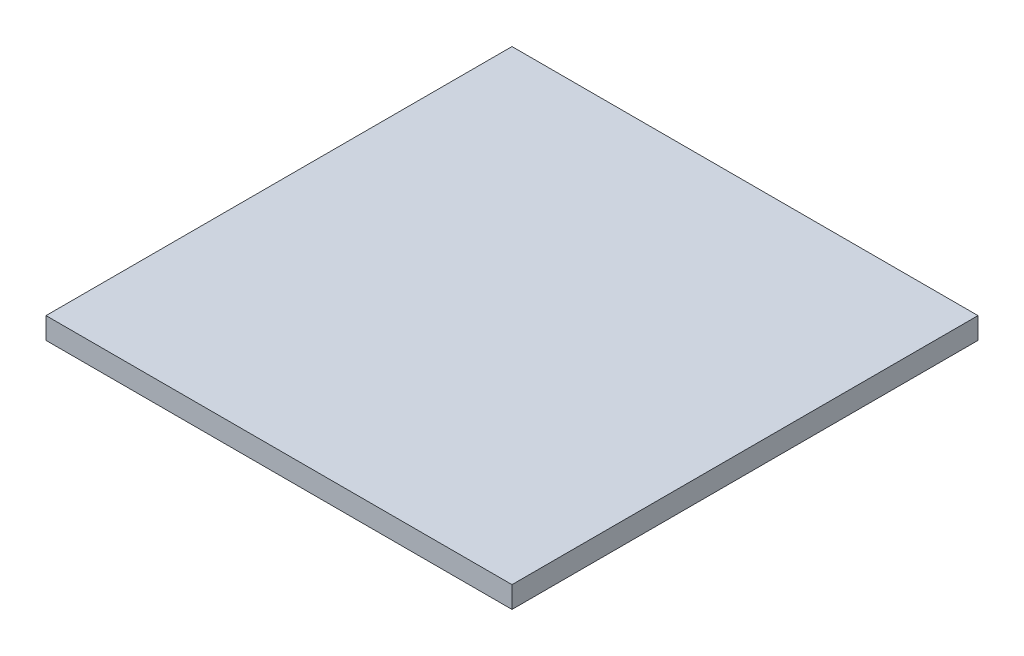
ISO-10303-21;
HEADER;
FILE_DESCRIPTION(('STEP AP214'),'2;1');
FILE_NAME('part.step','',(''),(''),'','','');
FILE_SCHEMA(('AUTOMOTIVE_DESIGN { 1 0 10303 214 1 1 1 1 }'));
ENDSEC;
DATA;
#1=APPLICATION_CONTEXT('core data for automotive mechanical design processes');
#2=APPLICATION_PROTOCOL_DEFINITION('international standard','automotive_design',2000,#1);
#3=PRODUCT_CONTEXT('',#1,'mechanical');
#4=PRODUCT('Part','Part','',(#3));
#5=PRODUCT_RELATED_PRODUCT_CATEGORY('part','',(#4));
#6=PRODUCT_DEFINITION_FORMATION('','',#4);
#7=PRODUCT_DEFINITION_CONTEXT('part definition',#1,'design');
#8=PRODUCT_DEFINITION('design','',#6,#7);
#9=PRODUCT_DEFINITION_SHAPE('','',#8);
#10=(LENGTH_UNIT() NAMED_UNIT(*) SI_UNIT(.MILLI.,.METRE.));
#11=(NAMED_UNIT(*) PLANE_ANGLE_UNIT() SI_UNIT($,.RADIAN.));
#12=(NAMED_UNIT(*) SI_UNIT($,.STERADIAN.) SOLID_ANGLE_UNIT());
#13=UNCERTAINTY_MEASURE_WITH_UNIT(LENGTH_MEASURE(1.E-05),#10,'distance_accuracy_value','');
#14=(GEOMETRIC_REPRESENTATION_CONTEXT(3) GLOBAL_UNCERTAINTY_ASSIGNED_CONTEXT((#13)) GLOBAL_UNIT_ASSIGNED_CONTEXT((#10,
#11,#12)) REPRESENTATION_CONTEXT('',''));
#15=CARTESIAN_POINT('',(0.,0.,0.));
#16=DIRECTION('',(0.,0.,1.));
#17=DIRECTION('',(1.,0.,0.));
#18=AXIS2_PLACEMENT_3D('',#15,#16,#17);
#19=CARTESIAN_POINT('',(0.297457153466129,35.4384983767566,197.163813233183));
#20=DIRECTION('',(0.,1.,0.));
#21=DIRECTION('',(0.,0.,1.));
#22=AXIS2_PLACEMENT_3D('',#19,#20,#21);
#23=PLANE('',#22);
#24=DIRECTION('',(0.,0.,-1.));
#25=VECTOR('',#24,1.);
#26=CARTESIAN_POINT('',(-16.2125428465339,35.4384983767566,180.653813233183));
#27=LINE('',#26,#25);
#28=CARTESIAN_POINT('',(-16.2125428465339,35.4384983767566,213.673813233183));
#29=VERTEX_POINT('',#28);
#30=CARTESIAN_POINT('',(-16.2125428465339,35.4384983767566,180.653813233183));
#31=VERTEX_POINT('',#30);
#32=EDGE_CURVE('E20',#29,#31,#27,.T.);
#33=ORIENTED_EDGE('',*,*,#32,.T.);
#34=DIRECTION('',(1.,0.,0.));
#35=VECTOR('',#34,1.);
#36=CARTESIAN_POINT('',(-16.2125428465339,35.4384983767566,180.653813233183));
#37=LINE('',#36,#35);
#38=CARTESIAN_POINT('',(16.8074571534661,35.4384983767566,180.653813233183));
#39=VERTEX_POINT('',#38);
#40=EDGE_CURVE('E88',#31,#39,#37,.T.);
#41=ORIENTED_EDGE('',*,*,#40,.T.);
#42=DIRECTION('',(0.,0.,1.));
#43=VECTOR('',#42,1.);
#44=CARTESIAN_POINT('',(16.8074571534661,35.4384983767566,180.653813233183));
#45=LINE('',#44,#43);
#46=CARTESIAN_POINT('',(16.8074571534661,35.4384983767566,213.673813233183));
#47=VERTEX_POINT('',#46);
#48=EDGE_CURVE('E56',#39,#47,#45,.T.);
#49=ORIENTED_EDGE('',*,*,#48,.T.);
#50=DIRECTION('',(-1.,0.,0.));
#51=VECTOR('',#50,1.);
#52=CARTESIAN_POINT('',(-16.2125428465339,35.4384983767566,213.673813233183));
#53=LINE('',#52,#51);
#54=EDGE_CURVE('E58',#47,#29,#53,.T.);
#55=ORIENTED_EDGE('',*,*,#54,.T.);
#56=EDGE_LOOP('',(#33,#41,#49,#55));
#57=FACE_BOUND('',#56,.T.);
#58=ADVANCED_FACE('F17',(#57),#23,.F.);
#59=CARTESIAN_POINT('',(-16.2125428465339,36.9624983767565,180.653813233183));
#60=DIRECTION('',(1.,0.,0.));
#61=DIRECTION('',(0.,0.,-1.));
#62=AXIS2_PLACEMENT_3D('',#59,#60,#61);
#63=PLANE('',#62);
#64=DIRECTION('',(0.,0.,1.));
#65=VECTOR('',#64,1.);
#66=CARTESIAN_POINT('',(-16.2125428465339,36.9624983767565,197.163813233183));
#67=LINE('',#66,#65);
#68=CARTESIAN_POINT('',(-16.2125428465339,36.9624983767565,180.653813233183));
#69=VERTEX_POINT('',#68);
#70=CARTESIAN_POINT('',(-16.2125428465339,36.9624983767565,213.673813233183));
#71=VERTEX_POINT('',#70);
#72=EDGE_CURVE('E95',#69,#71,#67,.T.);
#73=ORIENTED_EDGE('',*,*,#72,.F.);
#74=DIRECTION('',(0.,1.,0.));
#75=VECTOR('',#74,1.);
#76=CARTESIAN_POINT('',(-16.2125428465339,36.9624983767565,180.653813233183));
#77=LINE('',#76,#75);
#78=EDGE_CURVE('E70',#69,#31,#77,.F.);
#79=ORIENTED_EDGE('',*,*,#78,.T.);
#80=ORIENTED_EDGE('',*,*,#32,.F.);
#81=DIRECTION('',(0.,1.,0.));
#82=VECTOR('',#81,1.);
#83=CARTESIAN_POINT('',(-16.2125428465339,36.9624983767565,213.673813233183));
#84=LINE('',#83,#82);
#85=EDGE_CURVE('E65',#29,#71,#84,.T.);
#86=ORIENTED_EDGE('',*,*,#85,.T.);
#87=EDGE_LOOP('',(#73,#79,#80,#86));
#88=FACE_BOUND('',#87,.T.);
#89=ADVANCED_FACE('F67',(#88),#63,.F.);
#90=CARTESIAN_POINT('',(-16.2125428465339,36.9624983767565,213.673813233183));
#91=DIRECTION('',(0.,0.,-1.));
#92=DIRECTION('',(-1.,0.,0.));
#93=AXIS2_PLACEMENT_3D('',#90,#91,#92);
#94=PLANE('',#93);
#95=DIRECTION('',(1.,0.,0.));
#96=VECTOR('',#95,1.);
#97=CARTESIAN_POINT('',(0.297457153466129,36.9624983767565,213.673813233183));
#98=LINE('',#97,#96);
#99=CARTESIAN_POINT('',(16.8074571534661,36.9624983767565,213.673813233183));
#100=VERTEX_POINT('',#99);
#101=EDGE_CURVE('E75',#71,#100,#98,.T.);
#102=ORIENTED_EDGE('',*,*,#101,.F.);
#103=ORIENTED_EDGE('',*,*,#85,.F.);
#104=ORIENTED_EDGE('',*,*,#54,.F.);
#105=DIRECTION('',(0.,1.,0.));
#106=VECTOR('',#105,1.);
#107=CARTESIAN_POINT('',(16.8074571534661,36.9624983767565,213.673813233183));
#108=LINE('',#107,#106);
#109=EDGE_CURVE('E83',#47,#100,#108,.T.);
#110=ORIENTED_EDGE('',*,*,#109,.T.);
#111=EDGE_LOOP('',(#102,#103,#104,#110));
#112=FACE_BOUND('',#111,.T.);
#113=ADVANCED_FACE('F73',(#112),#94,.F.);
#114=CARTESIAN_POINT('',(16.8074571534661,36.9624983767565,180.653813233183));
#115=DIRECTION('',(-1.,0.,0.));
#116=DIRECTION('',(0.,0.,1.));
#117=AXIS2_PLACEMENT_3D('',#114,#115,#116);
#118=PLANE('',#117);
#119=DIRECTION('',(0.,0.,1.));
#120=VECTOR('',#119,1.);
#121=CARTESIAN_POINT('',(16.8074571534661,36.9624983767565,197.163813233183));
#122=LINE('',#121,#120);
#123=CARTESIAN_POINT('',(16.8074571534661,36.9624983767565,180.653813233183));
#124=VERTEX_POINT('',#123);
#125=EDGE_CURVE('E27',#100,#124,#122,.F.);
#126=ORIENTED_EDGE('',*,*,#125,.F.);
#127=ORIENTED_EDGE('',*,*,#109,.F.);
#128=ORIENTED_EDGE('',*,*,#48,.F.);
#129=DIRECTION('',(0.,1.,0.));
#130=VECTOR('',#129,1.);
#131=CARTESIAN_POINT('',(16.8074571534661,36.9624983767565,180.653813233183));
#132=LINE('',#131,#130);
#133=EDGE_CURVE('E36',#39,#124,#132,.T.);
#134=ORIENTED_EDGE('',*,*,#133,.T.);
#135=EDGE_LOOP('',(#126,#127,#128,#134));
#136=FACE_BOUND('',#135,.T.);
#137=ADVANCED_FACE('F102',(#136),#118,.F.);
#138=CARTESIAN_POINT('',(-16.2125428465339,36.9624983767565,180.653813233183));
#139=DIRECTION('',(0.,0.,1.));
#140=DIRECTION('',(1.,0.,0.));
#141=AXIS2_PLACEMENT_3D('',#138,#139,#140);
#142=PLANE('',#141);
#143=DIRECTION('',(1.,0.,0.));
#144=VECTOR('',#143,1.);
#145=CARTESIAN_POINT('',(0.297457153466129,36.9624983767565,180.653813233183));
#146=LINE('',#145,#144);
#147=EDGE_CURVE('E11',#124,#69,#146,.F.);
#148=ORIENTED_EDGE('',*,*,#147,.F.);
#149=ORIENTED_EDGE('',*,*,#133,.F.);
#150=ORIENTED_EDGE('',*,*,#40,.F.);
#151=ORIENTED_EDGE('',*,*,#78,.F.);
#152=EDGE_LOOP('',(#148,#149,#150,#151));
#153=FACE_BOUND('',#152,.T.);
#154=ADVANCED_FACE('F104',(#153),#142,.F.);
#155=CARTESIAN_POINT('',(0.297457153466129,36.9624983767565,197.163813233183));
#156=DIRECTION('',(0.,1.,0.));
#157=DIRECTION('',(0.,0.,1.));
#158=AXIS2_PLACEMENT_3D('',#155,#156,#157);
#159=PLANE('',#158);
#160=ORIENTED_EDGE('',*,*,#125,.T.);
#161=ORIENTED_EDGE('',*,*,#147,.T.);
#162=ORIENTED_EDGE('',*,*,#72,.T.);
#163=ORIENTED_EDGE('',*,*,#101,.T.);
#164=EDGE_LOOP('',(#160,#161,#162,#163));
#165=FACE_BOUND('',#164,.T.);
#166=ADVANCED_FACE('F101',(#165),#159,.T.);
#167=CLOSED_SHELL('',(#58,#89,#113,#137,#154,#166));
#168=MANIFOLD_SOLID_BREP('B1',#167);
#169=ADVANCED_BREP_SHAPE_REPRESENTATION('',(#18,#168),#14);
#170=SHAPE_DEFINITION_REPRESENTATION(#9,#169);
ENDSEC;
END-ISO-10303-21;
